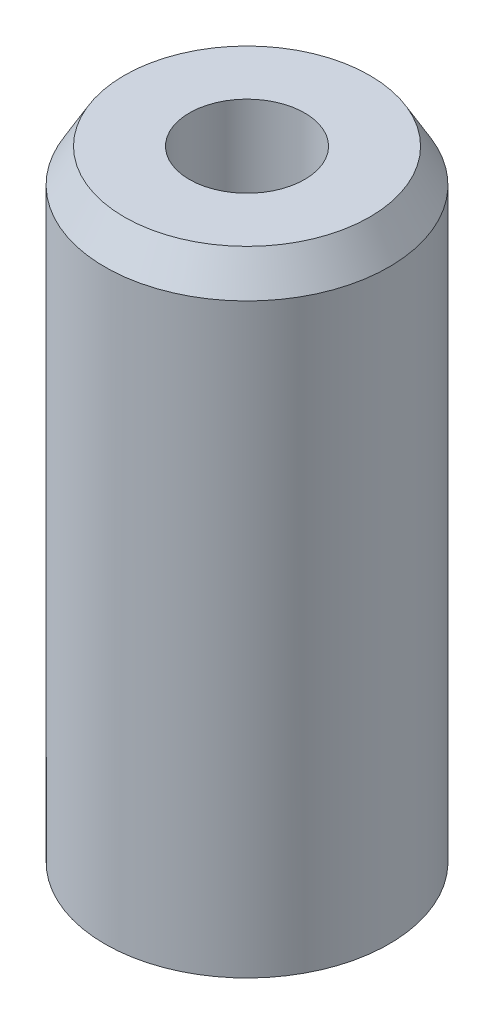
ISO-10303-21;
HEADER;
FILE_DESCRIPTION(('STEP AP214'),'2;1');
FILE_NAME('part.step','',(''),(''),'','','');
FILE_SCHEMA(('AUTOMOTIVE_DESIGN { 1 0 10303 214 1 1 1 1 }'));
ENDSEC;
DATA;
#1=APPLICATION_CONTEXT('core data for automotive mechanical design processes');
#2=APPLICATION_PROTOCOL_DEFINITION('international standard','automotive_design',2000,#1);
#3=PRODUCT_CONTEXT('',#1,'mechanical');
#4=PRODUCT('Part','Part','',(#3));
#5=PRODUCT_RELATED_PRODUCT_CATEGORY('part','',(#4));
#6=PRODUCT_DEFINITION_FORMATION('','',#4);
#7=PRODUCT_DEFINITION_CONTEXT('part definition',#1,'design');
#8=PRODUCT_DEFINITION('design','',#6,#7);
#9=PRODUCT_DEFINITION_SHAPE('','',#8);
#10=(LENGTH_UNIT() NAMED_UNIT(*) SI_UNIT(.MILLI.,.METRE.));
#11=(NAMED_UNIT(*) PLANE_ANGLE_UNIT() SI_UNIT($,.RADIAN.));
#12=(NAMED_UNIT(*) SI_UNIT($,.STERADIAN.) SOLID_ANGLE_UNIT());
#13=UNCERTAINTY_MEASURE_WITH_UNIT(LENGTH_MEASURE(1.E-05),#10,'distance_accuracy_value','');
#14=(GEOMETRIC_REPRESENTATION_CONTEXT(3) GLOBAL_UNCERTAINTY_ASSIGNED_CONTEXT((#13)) GLOBAL_UNIT_ASSIGNED_CONTEXT((#10,
#11,#12)) REPRESENTATION_CONTEXT('',''));
#15=CARTESIAN_POINT('',(0.,0.,0.));
#16=DIRECTION('',(0.,0.,1.));
#17=DIRECTION('',(1.,0.,0.));
#18=AXIS2_PLACEMENT_3D('',#15,#16,#17);
#19=CARTESIAN_POINT('',(0.,67.4815595254047,0.));
#20=DIRECTION('',(0.,-1.,0.));
#21=DIRECTION('',(0.,0.,-1.));
#22=AXIS2_PLACEMENT_3D('',#19,#20,#21);
#23=CYLINDRICAL_SURFACE('',#22,15.);
#24=CARTESIAN_POINT('',(0.,63.9372557112631,0.));
#25=DIRECTION('',(0.,1.,0.));
#26=DIRECTION('',(0.,0.,1.));
#27=AXIS2_PLACEMENT_3D('',#24,#25,#26);
#28=CIRCLE('',#27,15.);
#29=CARTESIAN_POINT('',(0.,63.9372557112631,-15.));
#30=VERTEX_POINT('',#29);
#31=EDGE_CURVE('E50',#30,#30,#28,.F.);
#32=ORIENTED_EDGE('',*,*,#31,.T.);
#33=EDGE_LOOP('',(#32));
#34=FACE_BOUND('',#33,.T.);
#35=CARTESIAN_POINT('',(0.,2.04630476118446,0.));
#36=DIRECTION('',(0.,1.,0.));
#37=DIRECTION('',(0.,0.,1.));
#38=AXIS2_PLACEMENT_3D('',#35,#36,#37);
#39=CIRCLE('',#38,15.);
#40=CARTESIAN_POINT('',(0.,2.04630476118446,15.));
#41=VERTEX_POINT('',#40);
#42=EDGE_CURVE('E51',#41,#41,#39,.T.);
#43=ORIENTED_EDGE('',*,*,#42,.T.);
#44=EDGE_LOOP('',(#43));
#45=FACE_BOUND('',#44,.T.);
#46=ADVANCED_FACE('F39',(#34,#45),#23,.T.);
#47=CARTESIAN_POINT('',(0.,67.4815595254047,0.));
#48=DIRECTION('',(0.,1.,0.));
#49=DIRECTION('',(0.,0.,1.));
#50=AXIS2_PLACEMENT_3D('',#47,#48,#49);
#51=PLANE('',#50);
#52=CARTESIAN_POINT('',(0.,67.4815595254047,0.));
#53=DIRECTION('',(0.,1.,0.));
#54=DIRECTION('',(0.,0.,1.));
#55=AXIS2_PLACEMENT_3D('',#52,#53,#54);
#56=CIRCLE('',#55,12.9536952388155);
#57=CARTESIAN_POINT('',(0.,67.4815595254047,-12.9536952388155));
#58=VERTEX_POINT('',#57);
#59=EDGE_CURVE('E54',#58,#58,#56,.T.);
#60=ORIENTED_EDGE('',*,*,#59,.T.);
#61=EDGE_LOOP('',(#60));
#62=FACE_BOUND('',#61,.T.);
#63=CARTESIAN_POINT('',(0.,67.4815595254047,0.));
#64=DIRECTION('',(0.,1.,0.));
#65=DIRECTION('',(0.,0.,1.));
#66=AXIS2_PLACEMENT_3D('',#63,#64,#65);
#67=CIRCLE('',#66,6.08758822350029);
#68=CARTESIAN_POINT('',(0.,67.4815595254047,6.08758822350029));
#69=VERTEX_POINT('',#68);
#70=EDGE_CURVE('E58',#69,#69,#67,.T.);
#71=ORIENTED_EDGE('',*,*,#70,.F.);
#72=EDGE_LOOP('',(#71));
#73=FACE_BOUND('',#72,.T.);
#74=ADVANCED_FACE('F69',(#62,#73),#51,.T.);
#75=CARTESIAN_POINT('',(0.,0.,0.));
#76=DIRECTION('',(0.,1.,0.));
#77=DIRECTION('',(0.,0.,1.));
#78=AXIS2_PLACEMENT_3D('',#75,#76,#77);
#79=PLANE('',#78);
#80=CARTESIAN_POINT('',(0.,0.,0.));
#81=DIRECTION('',(0.,1.,0.));
#82=DIRECTION('',(0.,0.,1.));
#83=AXIS2_PLACEMENT_3D('',#80,#81,#82);
#84=CIRCLE('',#83,11.4556961858584);
#85=CARTESIAN_POINT('',(0.,0.,11.4556961858584));
#86=VERTEX_POINT('',#85);
#87=EDGE_CURVE('E10',#86,#86,#84,.F.);
#88=ORIENTED_EDGE('',*,*,#87,.T.);
#89=EDGE_LOOP('',(#88));
#90=FACE_BOUND('',#89,.T.);
#91=CARTESIAN_POINT('',(0.,0.,0.));
#92=DIRECTION('',(0.,1.,0.));
#93=DIRECTION('',(0.,0.,1.));
#94=AXIS2_PLACEMENT_3D('',#91,#92,#93);
#95=CIRCLE('',#94,6.08758822350029);
#96=CARTESIAN_POINT('',(0.,0.,6.08758822350029));
#97=VERTEX_POINT('',#96);
#98=EDGE_CURVE('E63',#97,#97,#95,.T.);
#99=ORIENTED_EDGE('',*,*,#98,.T.);
#100=EDGE_LOOP('',(#99));
#101=FACE_BOUND('',#100,.T.);
#102=ADVANCED_FACE('F75',(#90,#101),#79,.F.);
#103=CARTESIAN_POINT('',(0.,67.4815595254047,0.));
#104=DIRECTION('',(0.,-1.,0.));
#105=DIRECTION('',(0.,0.,-1.));
#106=AXIS2_PLACEMENT_3D('',#103,#104,#105);
#107=CYLINDRICAL_SURFACE('',#106,6.08758822350029);
#108=ORIENTED_EDGE('',*,*,#70,.T.);
#109=EDGE_LOOP('',(#108));
#110=FACE_BOUND('',#109,.T.);
#111=ORIENTED_EDGE('',*,*,#98,.F.);
#112=EDGE_LOOP('',(#111));
#113=FACE_BOUND('',#112,.T.);
#114=ADVANCED_FACE('F70',(#110,#113),#107,.F.);
#115=CARTESIAN_POINT('',(0.,67.4815595254047,0.));
#116=DIRECTION('',(0.,-1.,0.));
#117=DIRECTION('',(0.,0.,-1.));
#118=AXIS2_PLACEMENT_3D('',#115,#116,#117);
#119=CONICAL_SURFACE('',#118,12.9536952388155,0.523598775598296);
#120=CARTESIAN_POINT('',(0.,63.9372557112631,-15.));
#121=CARTESIAN_POINT('',(0.,63.9741755426604,-14.9786843254043));
#122=CARTESIAN_POINT('',(0.,64.0110953740577,-14.9573686508087));
#123=CARTESIAN_POINT('',(0.,64.0849350368523,-14.9147373016173));
#124=CARTESIAN_POINT('',(0.,64.1218548682496,-14.8934216270216));
#125=CARTESIAN_POINT('',(0.,64.1956945310443,-14.8507902778303));
#126=CARTESIAN_POINT('',(0.,64.2326143624416,-14.8294746032346));
#127=CARTESIAN_POINT('',(0.,64.3064540252362,-14.7868432540433));
#128=CARTESIAN_POINT('',(0.,64.3433738566335,-14.7655275794476));
#129=CARTESIAN_POINT('',(0.,64.4172135194281,-14.7228962302563));
#130=CARTESIAN_POINT('',(0.,64.4541333508254,-14.7015805556606));
#131=CARTESIAN_POINT('',(0.,64.52797301362,-14.6589492064693));
#132=CARTESIAN_POINT('',(0.,64.5648928450173,-14.6376335318736));
#133=CARTESIAN_POINT('',(0.,64.638732507812,-14.5950021826822));
#134=CARTESIAN_POINT('',(0.,64.6756523392093,-14.5736865080866));
#135=CARTESIAN_POINT('',(0.,64.7494920020039,-14.5310551588952));
#136=CARTESIAN_POINT('',(0.,64.7864118334012,-14.5097394842996));
#137=CARTESIAN_POINT('',(0.,64.8602514961958,-14.4671081351082));
#138=CARTESIAN_POINT('',(0.,64.8971713275931,-14.4457924605125));
#139=CARTESIAN_POINT('',(0.,64.9710109903877,-14.4031611113212));
#140=CARTESIAN_POINT('',(0.,65.007930821785,-14.3818454367255));
#141=CARTESIAN_POINT('',(0.,65.0817704845796,-14.3392140875342));
#142=CARTESIAN_POINT('',(0.,65.118690315977,-14.3178984129385));
#143=CARTESIAN_POINT('',(0.,65.1925299787716,-14.2752670637472));
#144=CARTESIAN_POINT('',(0.,65.2294498101689,-14.2539513891515));
#145=CARTESIAN_POINT('',(0.,65.3032894729635,-14.2113200399602));
#146=CARTESIAN_POINT('',(0.,65.3402093043608,-14.1900043653645));
#147=CARTESIAN_POINT('',(0.,65.4140489671554,-14.1473730161731));
#148=CARTESIAN_POINT('',(0.,65.4509687985527,-14.1260573415775));
#149=CARTESIAN_POINT('',(0.,65.5248084613473,-14.0834259923861));
#150=CARTESIAN_POINT('',(0.,65.5617282927447,-14.0621103177905));
#151=CARTESIAN_POINT('',(0.,65.6355679555393,-14.0194789685991));
#152=CARTESIAN_POINT('',(0.,65.6724877869366,-13.9981632940034));
#153=CARTESIAN_POINT('',(0.,65.7463274497312,-13.9555319448121));
#154=CARTESIAN_POINT('',(0.,65.7832472811285,-13.9342162702164));
#155=CARTESIAN_POINT('',(0.,65.8570869439231,-13.8915849210251));
#156=CARTESIAN_POINT('',(0.,65.8940067753204,-13.8702692464294));
#157=CARTESIAN_POINT('',(0.,65.9678464381151,-13.8276378972381));
#158=CARTESIAN_POINT('',(0.,66.0047662695124,-13.8063222226424));
#159=CARTESIAN_POINT('',(0.,66.078605932307,-13.7636908734511));
#160=CARTESIAN_POINT('',(0.,66.1155257637043,-13.7423751988554));
#161=CARTESIAN_POINT('',(0.,66.1893654264989,-13.699743849664));
#162=CARTESIAN_POINT('',(0.,66.2262852578962,-13.6784281750684));
#163=CARTESIAN_POINT('',(0.,66.3001249206908,-13.635796825877));
#164=CARTESIAN_POINT('',(0.,66.3370447520881,-13.6144811512814));
#165=CARTESIAN_POINT('',(0.,66.4108844148828,-13.57184980209));
#166=CARTESIAN_POINT('',(0.,66.4478042462801,-13.5505341274944));
#167=CARTESIAN_POINT('',(0.,66.5216439090747,-13.507902778303));
#168=CARTESIAN_POINT('',(0.,66.558563740472,-13.4865871037073));
#169=CARTESIAN_POINT('',(0.,66.6324034032666,-13.443955754516));
#170=CARTESIAN_POINT('',(0.,66.6693232346639,-13.4226400799203));
#171=CARTESIAN_POINT('',(0.,66.7431628974585,-13.380008730729));
#172=CARTESIAN_POINT('',(0.,66.7800827288558,-13.3586930561333));
#173=CARTESIAN_POINT('',(0.,66.8539223916505,-13.316061706942));
#174=CARTESIAN_POINT('',(0.,66.8908422230478,-13.2947460323463));
#175=CARTESIAN_POINT('',(0.,66.9646818858424,-13.2521146831549));
#176=CARTESIAN_POINT('',(0.,67.0016017172397,-13.2307990085593));
#177=CARTESIAN_POINT('',(0.,67.0754413800343,-13.1881676593679));
#178=CARTESIAN_POINT('',(0.,67.1123612114316,-13.1668519847723));
#179=CARTESIAN_POINT('',(0.,67.1862008742262,-13.1242206355809));
#180=CARTESIAN_POINT('',(0.,67.2231207056235,-13.1029049609852));
#181=CARTESIAN_POINT('',(0.,67.2969603684182,-13.0602736117939));
#182=CARTESIAN_POINT('',(0.,67.3338801998155,-13.0389579371982));
#183=CARTESIAN_POINT('',(0.,67.4077198626101,-12.9963265880069));
#184=CARTESIAN_POINT('',(0.,67.4446396940074,-12.9750109134112));
#185=CARTESIAN_POINT('',(0.,67.4815595254047,-12.9536952388155));
#186=B_SPLINE_CURVE_WITH_KNOTS('',3,(#120,#121,#122,#123,#124,#125,#126,#127,#128,#129,#130,
#131,#132,#133,#134,#135,#136,#137,#138,#139,#140,#141,#142,#143,#144,#145,#146,#147,#148,#149,
#150,#151,#152,#153,#154,#155,#156,#157,#158,#159,#160,#161,#162,#163,#164,#165,#166,#167,#168,
#169,#170,#171,#172,#173,#174,#175,#176,#177,#178,#179,#180,#181,#182,#183,#184,#185),
.UNSPECIFIED.,.F.,.F.,(4,2,2,2,2,2,2,2,2,2,2,2,2,2,2,2,2,2,2,2,2,2,2,2,2,2,2,2,2,2,2,2,4),(0.,
0.127894047574029,0.25578809514806,0.383682142722089,0.511576190296119,0.639470237870148,
0.767364285444177,0.895258333018207,1.02315238059224,1.15104642816627,1.2789404757403,
1.40683452331433,1.53472857088835,1.66262261846238,1.79051666603641,1.91841071361044,
2.04630476118447,2.1741988087585,2.30209285633253,2.42998690390656,2.55788095148059,
2.68577499905462,2.81366904662865,2.94156309420268,3.06945714177671,3.19735118935074,
3.32524523692477,3.4531392844988,3.58103333207283,3.70892737964685,3.83682142722088,
3.96471547479491,4.09260952236894),.UNSPECIFIED.);
#187=EDGE_CURVE('BSEAM81',#30,#58,#186,.T.);
#188=ORIENTED_EDGE('',*,*,#31,.F.);
#189=ORIENTED_EDGE('',*,*,#59,.F.);
#190=ORIENTED_EDGE('',*,*,#187,.T.);
#191=ORIENTED_EDGE('',*,*,#187,.F.);
#192=EDGE_LOOP('',(#188,#190,#189,#191));
#193=FACE_BOUND('',#192,.T.);
#194=ADVANCED_FACE('F81',(#193),#119,.T.);
#195=CARTESIAN_POINT('',(0.,2.04630476118446,0.));
#196=DIRECTION('',(0.,1.,0.));
#197=DIRECTION('',(0.,0.,1.));
#198=AXIS2_PLACEMENT_3D('',#195,#196,#197);
#199=CONICAL_SURFACE('',#198,15.,1.0471975511966);
#200=ORIENTED_EDGE('',*,*,#87,.F.);
#201=EDGE_LOOP('',(#200));
#202=FACE_BOUND('',#201,.T.);
#203=ORIENTED_EDGE('',*,*,#42,.F.);
#204=EDGE_LOOP('',(#203));
#205=FACE_BOUND('',#204,.T.);
#206=ADVANCED_FACE('F45',(#202,#205),#199,.T.);
#207=CLOSED_SHELL('',(#46,#74,#102,#114,#194,#206));
#208=MANIFOLD_SOLID_BREP('B2',#207);
#209=ADVANCED_BREP_SHAPE_REPRESENTATION('',(#18,#208),#14);
#210=SHAPE_DEFINITION_REPRESENTATION(#9,#209);
ENDSEC;
END-ISO-10303-21;
